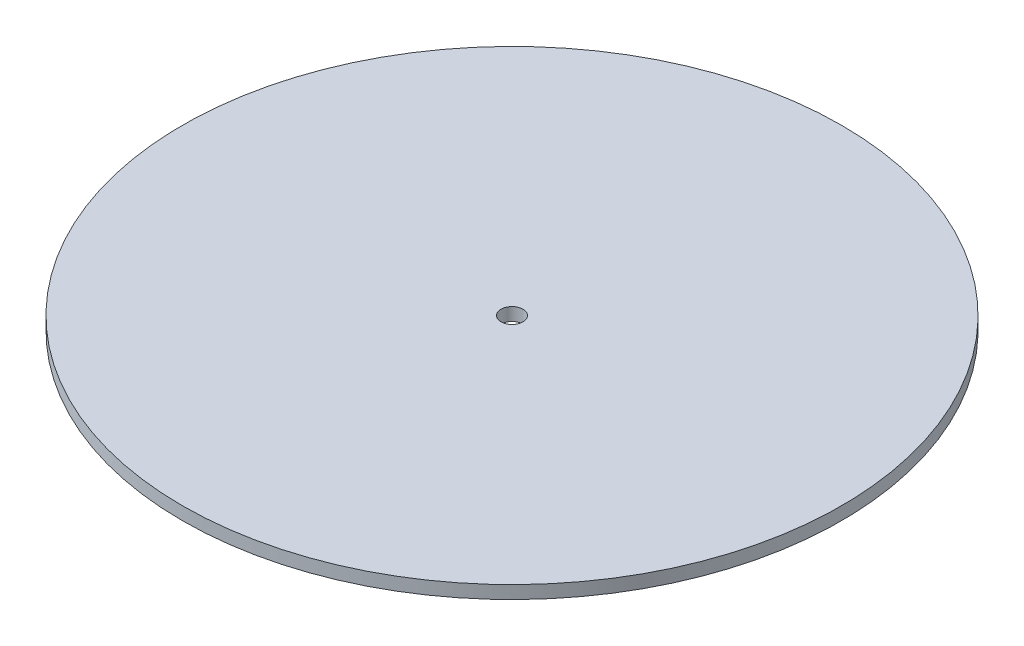
ISO-10303-21;
HEADER;
FILE_DESCRIPTION(('STEP AP214'),'2;1');
FILE_NAME('part.step','',(''),(''),'','','');
FILE_SCHEMA(('AUTOMOTIVE_DESIGN { 1 0 10303 214 1 1 1 1 }'));
ENDSEC;
DATA;
#1=APPLICATION_CONTEXT('core data for automotive mechanical design processes');
#2=APPLICATION_PROTOCOL_DEFINITION('international standard','automotive_design',2000,#1);
#3=PRODUCT_CONTEXT('',#1,'mechanical');
#4=PRODUCT('Part','Part','',(#3));
#5=PRODUCT_RELATED_PRODUCT_CATEGORY('part','',(#4));
#6=PRODUCT_DEFINITION_FORMATION('','',#4);
#7=PRODUCT_DEFINITION_CONTEXT('part definition',#1,'design');
#8=PRODUCT_DEFINITION('design','',#6,#7);
#9=PRODUCT_DEFINITION_SHAPE('','',#8);
#10=(LENGTH_UNIT() NAMED_UNIT(*) SI_UNIT(.MILLI.,.METRE.));
#11=(NAMED_UNIT(*) PLANE_ANGLE_UNIT() SI_UNIT($,.RADIAN.));
#12=(NAMED_UNIT(*) SI_UNIT($,.STERADIAN.) SOLID_ANGLE_UNIT());
#13=UNCERTAINTY_MEASURE_WITH_UNIT(LENGTH_MEASURE(1.E-05),#10,'distance_accuracy_value','');
#14=(GEOMETRIC_REPRESENTATION_CONTEXT(3) GLOBAL_UNCERTAINTY_ASSIGNED_CONTEXT((#13)) GLOBAL_UNIT_ASSIGNED_CONTEXT((#10,
#11,#12)) REPRESENTATION_CONTEXT('',''));
#15=CARTESIAN_POINT('',(0.,0.,0.));
#16=DIRECTION('',(0.,0.,1.));
#17=DIRECTION('',(1.,0.,0.));
#18=AXIS2_PLACEMENT_3D('',#15,#16,#17);
#19=CARTESIAN_POINT('',(0.,3.,0.));
#20=DIRECTION('',(0.,1.,0.));
#21=DIRECTION('',(0.,0.,1.));
#22=AXIS2_PLACEMENT_3D('',#19,#20,#21);
#23=PLANE('',#22);
#24=CARTESIAN_POINT('',(0.,3.,0.));
#25=DIRECTION('',(0.,1.,0.));
#26=DIRECTION('',(0.,0.,1.));
#27=AXIS2_PLACEMENT_3D('',#24,#25,#26);
#28=CIRCLE('',#27,76.2);
#29=CARTESIAN_POINT('',(0.,3.,76.2));
#30=VERTEX_POINT('',#29);
#31=EDGE_CURVE('E10',#30,#30,#28,.T.);
#32=ORIENTED_EDGE('',*,*,#31,.T.);
#33=EDGE_LOOP('',(#32));
#34=FACE_BOUND('',#33,.T.);
#35=CARTESIAN_POINT('',(0.,3.,0.));
#36=DIRECTION('',(0.,1.,0.));
#37=DIRECTION('',(0.,0.,1.));
#38=AXIS2_PLACEMENT_3D('',#35,#36,#37);
#39=CIRCLE('',#38,2.54);
#40=CARTESIAN_POINT('',(0.,3.,2.54));
#41=VERTEX_POINT('',#40);
#42=EDGE_CURVE('E42',#41,#41,#39,.T.);
#43=ORIENTED_EDGE('',*,*,#42,.F.);
#44=EDGE_LOOP('',(#43));
#45=FACE_BOUND('',#44,.T.);
#46=ADVANCED_FACE('F31',(#34,#45),#23,.T.);
#47=CARTESIAN_POINT('',(0.,0.,0.));
#48=DIRECTION('',(0.,1.,0.));
#49=DIRECTION('',(0.,0.,1.));
#50=AXIS2_PLACEMENT_3D('',#47,#48,#49);
#51=PLANE('',#50);
#52=CARTESIAN_POINT('',(0.,0.,0.));
#53=DIRECTION('',(0.,1.,0.));
#54=DIRECTION('',(0.,0.,1.));
#55=AXIS2_PLACEMENT_3D('',#52,#53,#54);
#56=CIRCLE('',#55,76.2);
#57=CARTESIAN_POINT('',(0.,0.,76.2));
#58=VERTEX_POINT('',#57);
#59=EDGE_CURVE('E35',#58,#58,#56,.T.);
#60=ORIENTED_EDGE('',*,*,#59,.F.);
#61=EDGE_LOOP('',(#60));
#62=FACE_BOUND('',#61,.T.);
#63=CARTESIAN_POINT('',(0.,0.,0.));
#64=DIRECTION('',(0.,1.,0.));
#65=DIRECTION('',(0.,0.,1.));
#66=AXIS2_PLACEMENT_3D('',#63,#64,#65);
#67=CIRCLE('',#66,2.54);
#68=CARTESIAN_POINT('',(0.,0.,2.54));
#69=VERTEX_POINT('',#68);
#70=EDGE_CURVE('E44',#69,#69,#67,.T.);
#71=ORIENTED_EDGE('',*,*,#70,.T.);
#72=EDGE_LOOP('',(#71));
#73=FACE_BOUND('',#72,.T.);
#74=ADVANCED_FACE('F54',(#62,#73),#51,.F.);
#75=CARTESIAN_POINT('',(0.,3.,0.));
#76=DIRECTION('',(0.,-1.,0.));
#77=DIRECTION('',(0.,0.,-1.));
#78=AXIS2_PLACEMENT_3D('',#75,#76,#77);
#79=CYLINDRICAL_SURFACE('',#78,76.2);
#80=ORIENTED_EDGE('',*,*,#31,.F.);
#81=EDGE_LOOP('',(#80));
#82=FACE_BOUND('',#81,.T.);
#83=ORIENTED_EDGE('',*,*,#59,.T.);
#84=EDGE_LOOP('',(#83));
#85=FACE_BOUND('',#84,.T.);
#86=ADVANCED_FACE('F33',(#82,#85),#79,.T.);
#87=CARTESIAN_POINT('',(0.,3.,0.));
#88=DIRECTION('',(0.,-1.,0.));
#89=DIRECTION('',(0.,0.,-1.));
#90=AXIS2_PLACEMENT_3D('',#87,#88,#89);
#91=CYLINDRICAL_SURFACE('',#90,2.54);
#92=ORIENTED_EDGE('',*,*,#42,.T.);
#93=EDGE_LOOP('',(#92));
#94=FACE_BOUND('',#93,.T.);
#95=ORIENTED_EDGE('',*,*,#70,.F.);
#96=EDGE_LOOP('',(#95));
#97=FACE_BOUND('',#96,.T.);
#98=ADVANCED_FACE('F50',(#94,#97),#91,.F.);
#99=CLOSED_SHELL('',(#46,#74,#86,#98));
#100=MANIFOLD_SOLID_BREP('B2',#99);
#101=ADVANCED_BREP_SHAPE_REPRESENTATION('',(#18,#100),#14);
#102=SHAPE_DEFINITION_REPRESENTATION(#9,#101);
ENDSEC;
END-ISO-10303-21;
